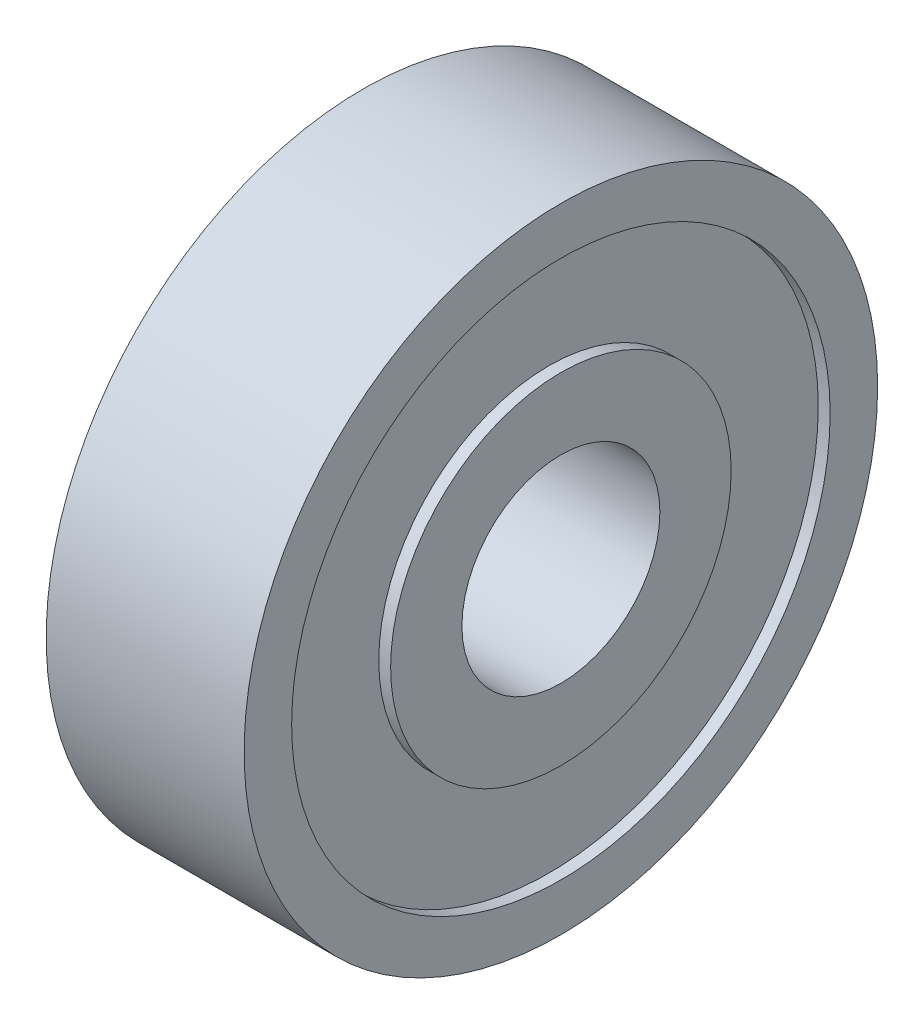
ISO-10303-21;
HEADER;
FILE_DESCRIPTION(('STEP AP214'),'2;1');
FILE_NAME('part.step','',(''),(''),'','','');
FILE_SCHEMA(('AUTOMOTIVE_DESIGN { 1 0 10303 214 1 1 1 1 }'));
ENDSEC;
DATA;
#1=APPLICATION_CONTEXT('core data for automotive mechanical design processes');
#2=APPLICATION_PROTOCOL_DEFINITION('international standard','automotive_design',2000,#1);
#3=PRODUCT_CONTEXT('',#1,'mechanical');
#4=PRODUCT('Part','Part','',(#3));
#5=PRODUCT_RELATED_PRODUCT_CATEGORY('part','',(#4));
#6=PRODUCT_DEFINITION_FORMATION('','',#4);
#7=PRODUCT_DEFINITION_CONTEXT('part definition',#1,'design');
#8=PRODUCT_DEFINITION('design','',#6,#7);
#9=PRODUCT_DEFINITION_SHAPE('','',#8);
#10=(LENGTH_UNIT() NAMED_UNIT(*) SI_UNIT(.MILLI.,.METRE.));
#11=(NAMED_UNIT(*) PLANE_ANGLE_UNIT() SI_UNIT($,.RADIAN.));
#12=(NAMED_UNIT(*) SI_UNIT($,.STERADIAN.) SOLID_ANGLE_UNIT());
#13=UNCERTAINTY_MEASURE_WITH_UNIT(LENGTH_MEASURE(1.E-05),#10,'distance_accuracy_value','');
#14=(GEOMETRIC_REPRESENTATION_CONTEXT(3) GLOBAL_UNCERTAINTY_ASSIGNED_CONTEXT((#13)) GLOBAL_UNIT_ASSIGNED_CONTEXT((#10,
#11,#12)) REPRESENTATION_CONTEXT('',''));
#15=CARTESIAN_POINT('',(0.,0.,0.));
#16=DIRECTION('',(0.,0.,1.));
#17=DIRECTION('',(1.,0.,0.));
#18=AXIS2_PLACEMENT_3D('',#15,#16,#17);
#19=CARTESIAN_POINT('',(-2.5,2.5,0.));
#20=DIRECTION('',(-1.,0.,0.));
#21=DIRECTION('',(0.,0.,1.));
#22=AXIS2_PLACEMENT_3D('',#19,#20,#21);
#23=PLANE('',#22);
#24=CARTESIAN_POINT('',(-2.5,0.,0.));
#25=DIRECTION('',(1.,0.,0.));
#26=DIRECTION('',(0.,0.,-1.));
#27=AXIS2_PLACEMENT_3D('',#24,#25,#26);
#28=CIRCLE('',#27,2.5);
#29=CARTESIAN_POINT('',(-2.5,0.,-2.5));
#30=VERTEX_POINT('',#29);
#31=EDGE_CURVE('E90',#30,#30,#28,.T.);
#32=ORIENTED_EDGE('',*,*,#31,.T.);
#33=EDGE_LOOP('',(#32));
#34=FACE_BOUND('',#33,.T.);
#35=CARTESIAN_POINT('',(-2.5,0.,0.));
#36=DIRECTION('',(1.,0.,0.));
#37=DIRECTION('',(0.,0.,-1.));
#38=AXIS2_PLACEMENT_3D('',#35,#36,#37);
#39=CIRCLE('',#38,4.3);
#40=CARTESIAN_POINT('',(-2.5,0.,-4.3));
#41=VERTEX_POINT('',#40);
#42=EDGE_CURVE('E10',#41,#41,#39,.T.);
#43=ORIENTED_EDGE('',*,*,#42,.F.);
#44=EDGE_LOOP('',(#43));
#45=FACE_BOUND('',#44,.T.);
#46=ADVANCED_FACE('F38',(#34,#45),#23,.T.);
#47=CARTESIAN_POINT('',(0.,0.,0.));
#48=DIRECTION('',(1.,0.,0.));
#49=DIRECTION('',(0.,0.,-1.));
#50=AXIS2_PLACEMENT_3D('',#47,#48,#49);
#51=CYLINDRICAL_SURFACE('',#50,4.3);
#52=ORIENTED_EDGE('',*,*,#42,.T.);
#53=EDGE_LOOP('',(#52));
#54=FACE_BOUND('',#53,.T.);
#55=CARTESIAN_POINT('',(-2.2,0.,0.));
#56=DIRECTION('',(1.,0.,0.));
#57=DIRECTION('',(0.,0.,-1.));
#58=AXIS2_PLACEMENT_3D('',#55,#56,#57);
#59=CIRCLE('',#58,4.3);
#60=CARTESIAN_POINT('',(-2.2,0.,-4.3));
#61=VERTEX_POINT('',#60);
#62=EDGE_CURVE('E45',#61,#61,#59,.T.);
#63=ORIENTED_EDGE('',*,*,#62,.F.);
#64=EDGE_LOOP('',(#63));
#65=FACE_BOUND('',#64,.T.);
#66=ADVANCED_FACE('F108',(#54,#65),#51,.T.);
#67=CARTESIAN_POINT('',(-2.2,4.3,0.));
#68=DIRECTION('',(-1.,0.,0.));
#69=DIRECTION('',(0.,0.,1.));
#70=AXIS2_PLACEMENT_3D('',#67,#68,#69);
#71=PLANE('',#70);
#72=ORIENTED_EDGE('',*,*,#62,.T.);
#73=EDGE_LOOP('',(#72));
#74=FACE_BOUND('',#73,.T.);
#75=CARTESIAN_POINT('',(-2.2,0.,0.));
#76=DIRECTION('',(1.,0.,0.));
#77=DIRECTION('',(0.,0.,-1.));
#78=AXIS2_PLACEMENT_3D('',#75,#76,#77);
#79=CIRCLE('',#78,6.8);
#80=CARTESIAN_POINT('',(-2.2,0.,-6.8));
#81=VERTEX_POINT('',#80);
#82=EDGE_CURVE('E51',#81,#81,#79,.T.);
#83=ORIENTED_EDGE('',*,*,#82,.F.);
#84=EDGE_LOOP('',(#83));
#85=FACE_BOUND('',#84,.T.);
#86=ADVANCED_FACE('F112',(#74,#85),#71,.T.);
#87=CARTESIAN_POINT('',(0.,0.,0.));
#88=DIRECTION('',(1.,0.,0.));
#89=DIRECTION('',(0.,0.,-1.));
#90=AXIS2_PLACEMENT_3D('',#87,#88,#89);
#91=CYLINDRICAL_SURFACE('',#90,6.8);
#92=ORIENTED_EDGE('',*,*,#82,.T.);
#93=EDGE_LOOP('',(#92));
#94=FACE_BOUND('',#93,.T.);
#95=CARTESIAN_POINT('',(-2.5,0.,0.));
#96=DIRECTION('',(1.,0.,0.));
#97=DIRECTION('',(0.,0.,-1.));
#98=AXIS2_PLACEMENT_3D('',#95,#96,#97);
#99=CIRCLE('',#98,6.8);
#100=CARTESIAN_POINT('',(-2.5,0.,-6.8));
#101=VERTEX_POINT('',#100);
#102=EDGE_CURVE('E57',#101,#101,#99,.T.);
#103=ORIENTED_EDGE('',*,*,#102,.F.);
#104=EDGE_LOOP('',(#103));
#105=FACE_BOUND('',#104,.T.);
#106=ADVANCED_FACE('F116',(#94,#105),#91,.F.);
#107=CARTESIAN_POINT('',(-2.5,6.8,0.));
#108=DIRECTION('',(-1.,0.,0.));
#109=DIRECTION('',(0.,0.,1.));
#110=AXIS2_PLACEMENT_3D('',#107,#108,#109);
#111=PLANE('',#110);
#112=ORIENTED_EDGE('',*,*,#102,.T.);
#113=EDGE_LOOP('',(#112));
#114=FACE_BOUND('',#113,.T.);
#115=CARTESIAN_POINT('',(-2.5,0.,0.));
#116=DIRECTION('',(1.,0.,0.));
#117=DIRECTION('',(0.,0.,-1.));
#118=AXIS2_PLACEMENT_3D('',#115,#116,#117);
#119=CIRCLE('',#118,8.);
#120=CARTESIAN_POINT('',(-2.5,0.,-8.));
#121=VERTEX_POINT('',#120);
#122=EDGE_CURVE('E62',#121,#121,#119,.T.);
#123=ORIENTED_EDGE('',*,*,#122,.F.);
#124=EDGE_LOOP('',(#123));
#125=FACE_BOUND('',#124,.T.);
#126=ADVANCED_FACE('F122',(#114,#125),#111,.T.);
#127=CARTESIAN_POINT('',(0.,0.,0.));
#128=DIRECTION('',(1.,0.,0.));
#129=DIRECTION('',(0.,0.,-1.));
#130=AXIS2_PLACEMENT_3D('',#127,#128,#129);
#131=CYLINDRICAL_SURFACE('',#130,8.);
#132=ORIENTED_EDGE('',*,*,#122,.T.);
#133=EDGE_LOOP('',(#132));
#134=FACE_BOUND('',#133,.T.);
#135=CARTESIAN_POINT('',(2.5,0.,0.));
#136=DIRECTION('',(1.,0.,0.));
#137=DIRECTION('',(0.,0.,-1.));
#138=AXIS2_PLACEMENT_3D('',#135,#136,#137);
#139=CIRCLE('',#138,8.);
#140=CARTESIAN_POINT('',(2.5,0.,-8.));
#141=VERTEX_POINT('',#140);
#142=EDGE_CURVE('E66',#141,#141,#139,.T.);
#143=ORIENTED_EDGE('',*,*,#142,.F.);
#144=EDGE_LOOP('',(#143));
#145=FACE_BOUND('',#144,.T.);
#146=ADVANCED_FACE('F126',(#134,#145),#131,.T.);
#147=CARTESIAN_POINT('',(2.5,6.8,0.));
#148=DIRECTION('',(1.,0.,0.));
#149=DIRECTION('',(0.,0.,-1.));
#150=AXIS2_PLACEMENT_3D('',#147,#148,#149);
#151=PLANE('',#150);
#152=ORIENTED_EDGE('',*,*,#142,.T.);
#153=EDGE_LOOP('',(#152));
#154=FACE_BOUND('',#153,.T.);
#155=CARTESIAN_POINT('',(2.5,0.,0.));
#156=DIRECTION('',(1.,0.,0.));
#157=DIRECTION('',(0.,0.,-1.));
#158=AXIS2_PLACEMENT_3D('',#155,#156,#157);
#159=CIRCLE('',#158,6.8);
#160=CARTESIAN_POINT('',(2.5,0.,-6.8));
#161=VERTEX_POINT('',#160);
#162=EDGE_CURVE('E70',#161,#161,#159,.T.);
#163=ORIENTED_EDGE('',*,*,#162,.F.);
#164=EDGE_LOOP('',(#163));
#165=FACE_BOUND('',#164,.T.);
#166=ADVANCED_FACE('F130',(#154,#165),#151,.T.);
#167=CARTESIAN_POINT('',(0.,0.,0.));
#168=DIRECTION('',(1.,0.,0.));
#169=DIRECTION('',(0.,0.,-1.));
#170=AXIS2_PLACEMENT_3D('',#167,#168,#169);
#171=CYLINDRICAL_SURFACE('',#170,6.8);
#172=ORIENTED_EDGE('',*,*,#162,.T.);
#173=EDGE_LOOP('',(#172));
#174=FACE_BOUND('',#173,.T.);
#175=CARTESIAN_POINT('',(2.2,0.,0.));
#176=DIRECTION('',(1.,0.,0.));
#177=DIRECTION('',(0.,0.,-1.));
#178=AXIS2_PLACEMENT_3D('',#175,#176,#177);
#179=CIRCLE('',#178,6.8);
#180=CARTESIAN_POINT('',(2.2,0.,-6.8));
#181=VERTEX_POINT('',#180);
#182=EDGE_CURVE('E74',#181,#181,#179,.T.);
#183=ORIENTED_EDGE('',*,*,#182,.F.);
#184=EDGE_LOOP('',(#183));
#185=FACE_BOUND('',#184,.T.);
#186=ADVANCED_FACE('F134',(#174,#185),#171,.F.);
#187=CARTESIAN_POINT('',(2.2,4.3,0.));
#188=DIRECTION('',(1.,0.,0.));
#189=DIRECTION('',(0.,0.,-1.));
#190=AXIS2_PLACEMENT_3D('',#187,#188,#189);
#191=PLANE('',#190);
#192=ORIENTED_EDGE('',*,*,#182,.T.);
#193=EDGE_LOOP('',(#192));
#194=FACE_BOUND('',#193,.T.);
#195=CARTESIAN_POINT('',(2.2,0.,0.));
#196=DIRECTION('',(1.,0.,0.));
#197=DIRECTION('',(0.,0.,-1.));
#198=AXIS2_PLACEMENT_3D('',#195,#196,#197);
#199=CIRCLE('',#198,4.3);
#200=CARTESIAN_POINT('',(2.2,0.,-4.3));
#201=VERTEX_POINT('',#200);
#202=EDGE_CURVE('E78',#201,#201,#199,.T.);
#203=ORIENTED_EDGE('',*,*,#202,.F.);
#204=EDGE_LOOP('',(#203));
#205=FACE_BOUND('',#204,.T.);
#206=ADVANCED_FACE('F138',(#194,#205),#191,.T.);
#207=CARTESIAN_POINT('',(0.,0.,0.));
#208=DIRECTION('',(1.,0.,0.));
#209=DIRECTION('',(0.,0.,-1.));
#210=AXIS2_PLACEMENT_3D('',#207,#208,#209);
#211=CYLINDRICAL_SURFACE('',#210,4.3);
#212=ORIENTED_EDGE('',*,*,#202,.T.);
#213=EDGE_LOOP('',(#212));
#214=FACE_BOUND('',#213,.T.);
#215=CARTESIAN_POINT('',(2.5,0.,0.));
#216=DIRECTION('',(1.,0.,0.));
#217=DIRECTION('',(0.,0.,-1.));
#218=AXIS2_PLACEMENT_3D('',#215,#216,#217);
#219=CIRCLE('',#218,4.3);
#220=CARTESIAN_POINT('',(2.5,0.,-4.3));
#221=VERTEX_POINT('',#220);
#222=EDGE_CURVE('E82',#221,#221,#219,.T.);
#223=ORIENTED_EDGE('',*,*,#222,.F.);
#224=EDGE_LOOP('',(#223));
#225=FACE_BOUND('',#224,.T.);
#226=ADVANCED_FACE('F104',(#214,#225),#211,.T.);
#227=CARTESIAN_POINT('',(2.5,2.5,0.));
#228=DIRECTION('',(1.,0.,0.));
#229=DIRECTION('',(0.,0.,-1.));
#230=AXIS2_PLACEMENT_3D('',#227,#228,#229);
#231=PLANE('',#230);
#232=ORIENTED_EDGE('',*,*,#222,.T.);
#233=EDGE_LOOP('',(#232));
#234=FACE_BOUND('',#233,.T.);
#235=CARTESIAN_POINT('',(2.5,0.,0.));
#236=DIRECTION('',(1.,0.,0.));
#237=DIRECTION('',(0.,0.,-1.));
#238=AXIS2_PLACEMENT_3D('',#235,#236,#237);
#239=CIRCLE('',#238,2.5);
#240=CARTESIAN_POINT('',(2.5,0.,-2.5));
#241=VERTEX_POINT('',#240);
#242=EDGE_CURVE('E86',#241,#241,#239,.T.);
#243=ORIENTED_EDGE('',*,*,#242,.F.);
#244=EDGE_LOOP('',(#243));
#245=FACE_BOUND('',#244,.T.);
#246=ADVANCED_FACE('F98',(#234,#245),#231,.T.);
#247=CARTESIAN_POINT('',(0.,0.,0.));
#248=DIRECTION('',(1.,0.,0.));
#249=DIRECTION('',(0.,0.,-1.));
#250=AXIS2_PLACEMENT_3D('',#247,#248,#249);
#251=CYLINDRICAL_SURFACE('',#250,2.5);
#252=ORIENTED_EDGE('',*,*,#242,.T.);
#253=EDGE_LOOP('',(#252));
#254=FACE_BOUND('',#253,.T.);
#255=ORIENTED_EDGE('',*,*,#31,.F.);
#256=EDGE_LOOP('',(#255));
#257=FACE_BOUND('',#256,.T.);
#258=ADVANCED_FACE('F96',(#254,#257),#251,.F.);
#259=CLOSED_SHELL('',(#46,#66,#86,#106,#126,#146,#166,#186,#206,#226,#246,#258));
#260=MANIFOLD_SOLID_BREP('B2',#259);
#261=ADVANCED_BREP_SHAPE_REPRESENTATION('',(#18,#260),#14);
#262=SHAPE_DEFINITION_REPRESENTATION(#9,#261);
ENDSEC;
END-ISO-10303-21;
